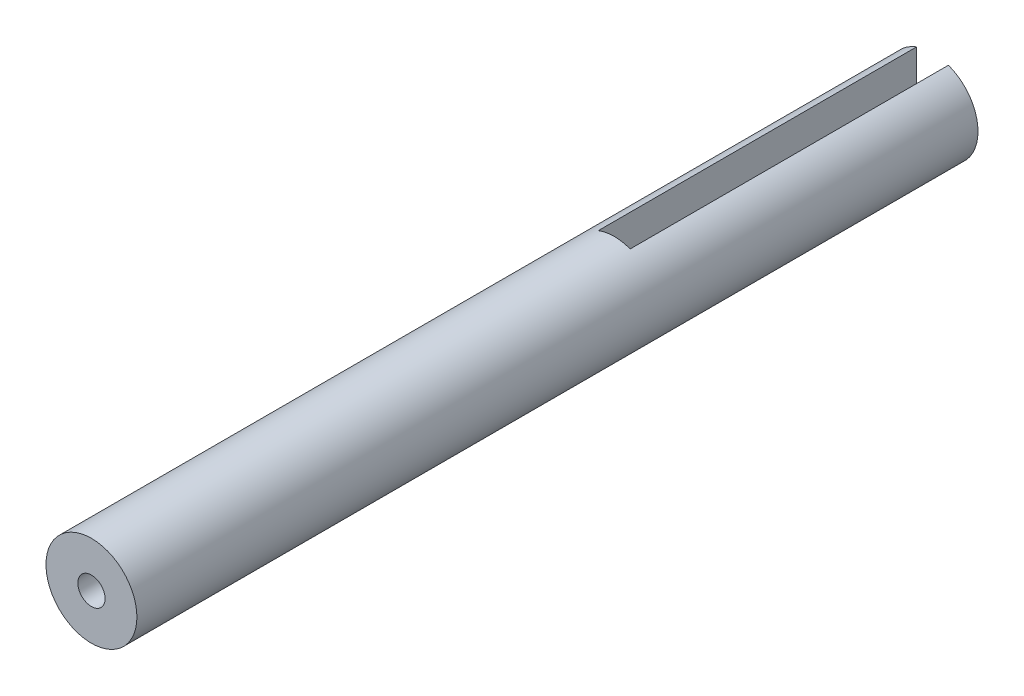
ISO-10303-21;
HEADER;
FILE_DESCRIPTION(('STEP AP214'),'2;1');
FILE_NAME('part.step','',(''),(''),'','','');
FILE_SCHEMA(('AUTOMOTIVE_DESIGN { 1 0 10303 214 1 1 1 1 }'));
ENDSEC;
DATA;
#1=APPLICATION_CONTEXT('core data for automotive mechanical design processes');
#2=APPLICATION_PROTOCOL_DEFINITION('international standard','automotive_design',2000,#1);
#3=PRODUCT_CONTEXT('',#1,'mechanical');
#4=PRODUCT('Part','Part','',(#3));
#5=PRODUCT_RELATED_PRODUCT_CATEGORY('part','',(#4));
#6=PRODUCT_DEFINITION_FORMATION('','',#4);
#7=PRODUCT_DEFINITION_CONTEXT('part definition',#1,'design');
#8=PRODUCT_DEFINITION('design','',#6,#7);
#9=PRODUCT_DEFINITION_SHAPE('','',#8);
#10=(LENGTH_UNIT() NAMED_UNIT(*) SI_UNIT(.MILLI.,.METRE.));
#11=(NAMED_UNIT(*) PLANE_ANGLE_UNIT() SI_UNIT($,.RADIAN.));
#12=(NAMED_UNIT(*) SI_UNIT($,.STERADIAN.) SOLID_ANGLE_UNIT());
#13=UNCERTAINTY_MEASURE_WITH_UNIT(LENGTH_MEASURE(1.E-05),#10,'distance_accuracy_value','');
#14=(GEOMETRIC_REPRESENTATION_CONTEXT(3) GLOBAL_UNCERTAINTY_ASSIGNED_CONTEXT((#13)) GLOBAL_UNIT_ASSIGNED_CONTEXT((#10,
#11,#12)) REPRESENTATION_CONTEXT('',''));
#15=CARTESIAN_POINT('',(0.,0.,0.));
#16=DIRECTION('',(0.,0.,1.));
#17=DIRECTION('',(1.,0.,0.));
#18=AXIS2_PLACEMENT_3D('',#15,#16,#17);
#19=CARTESIAN_POINT('',(0.,0.,0.));
#20=DIRECTION('',(0.,0.,1.));
#21=DIRECTION('',(1.,0.,0.));
#22=AXIS2_PLACEMENT_3D('',#19,#20,#21);
#23=PLANE('',#22);
#24=DIRECTION('',(0.,-1.,0.));
#25=VECTOR('',#24,1.);
#26=CARTESIAN_POINT('',(-3.5,0.,0.));
#27=LINE('',#26,#25);
#28=CARTESIAN_POINT('',(-3.5,9.3674969975976,0.));
#29=VERTEX_POINT('',#28);
#30=CARTESIAN_POINT('',(-3.5,-9.3674969975976,0.));
#31=VERTEX_POINT('',#30);
#32=EDGE_CURVE('E89',#29,#31,#27,.T.);
#33=ORIENTED_EDGE('',*,*,#32,.T.);
#34=CARTESIAN_POINT('',(0.,0.,0.));
#35=DIRECTION('',(0.,0.,1.));
#36=DIRECTION('',(1.,0.,0.));
#37=AXIS2_PLACEMENT_3D('',#34,#35,#36);
#38=CIRCLE('',#37,10.);
#39=EDGE_CURVE('E47',#29,#31,#38,.T.);
#40=ORIENTED_EDGE('',*,*,#39,.F.);
#41=EDGE_LOOP('',(#33,#40));
#42=FACE_BOUND('',#41,.T.);
#43=ADVANCED_FACE('F37',(#42),#23,.F.);
#44=CARTESIAN_POINT('',(0.,0.,185.));
#45=DIRECTION('',(0.,0.,-1.));
#46=DIRECTION('',(-1.,0.,0.));
#47=AXIS2_PLACEMENT_3D('',#44,#45,#46);
#48=CYLINDRICAL_SURFACE('',#47,10.);
#49=CARTESIAN_POINT('',(3.5,-9.3674969975976,0.));
#50=VERTEX_POINT('',#49);
#51=CARTESIAN_POINT('',(3.5,9.3674969975976,0.));
#52=VERTEX_POINT('',#51);
#53=EDGE_CURVE('E41',#50,#52,#38,.T.);
#54=ORIENTED_EDGE('',*,*,#53,.T.);
#55=DIRECTION('',(0.,0.,-1.));
#56=VECTOR('',#55,1.);
#57=CARTESIAN_POINT('',(3.5,9.3674969975976,70.));
#58=LINE('',#57,#56);
#59=CARTESIAN_POINT('',(3.5,9.3674969975976,70.));
#60=VERTEX_POINT('',#59);
#61=EDGE_CURVE('E94',#60,#52,#58,.T.);
#62=ORIENTED_EDGE('',*,*,#61,.F.);
#63=CARTESIAN_POINT('',(0.,0.,70.));
#64=DIRECTION('',(0.,0.,1.));
#65=DIRECTION('',(1.,0.,0.));
#66=AXIS2_PLACEMENT_3D('',#63,#64,#65);
#67=CIRCLE('',#66,10.);
#68=CARTESIAN_POINT('',(-3.5,9.3674969975976,70.));
#69=VERTEX_POINT('',#68);
#70=EDGE_CURVE('E82',#60,#69,#67,.T.);
#71=ORIENTED_EDGE('',*,*,#70,.T.);
#72=DIRECTION('',(0.,0.,-1.));
#73=VECTOR('',#72,1.);
#74=CARTESIAN_POINT('',(-3.5,9.3674969975976,70.));
#75=LINE('',#74,#73);
#76=EDGE_CURVE('E85',#69,#29,#75,.T.);
#77=ORIENTED_EDGE('',*,*,#76,.T.);
#78=ORIENTED_EDGE('',*,*,#39,.T.);
#79=DIRECTION('',(0.,0.,-1.));
#80=VECTOR('',#79,1.);
#81=CARTESIAN_POINT('',(-3.5,-9.3674969975976,70.));
#82=LINE('',#81,#80);
#83=CARTESIAN_POINT('',(-3.5,-9.3674969975976,70.));
#84=VERTEX_POINT('',#83);
#85=EDGE_CURVE('E54',#84,#31,#82,.T.);
#86=ORIENTED_EDGE('',*,*,#85,.F.);
#87=CARTESIAN_POINT('',(3.5,-9.3674969975976,70.));
#88=VERTEX_POINT('',#87);
#89=EDGE_CURVE('E98',#84,#88,#67,.T.);
#90=ORIENTED_EDGE('',*,*,#89,.T.);
#91=DIRECTION('',(0.,0.,-1.));
#92=VECTOR('',#91,1.);
#93=CARTESIAN_POINT('',(3.5,-9.3674969975976,70.));
#94=LINE('',#93,#92);
#95=EDGE_CURVE('E63',#88,#50,#94,.T.);
#96=ORIENTED_EDGE('',*,*,#95,.T.);
#97=EDGE_LOOP('',(#54,#62,#71,#77,#78,#86,#90,#96));
#98=FACE_BOUND('',#97,.T.);
#99=CARTESIAN_POINT('',(0.,0.,185.));
#100=DIRECTION('',(0.,0.,1.));
#101=DIRECTION('',(1.,0.,0.));
#102=AXIS2_PLACEMENT_3D('',#99,#100,#101);
#103=CIRCLE('',#102,10.);
#104=CARTESIAN_POINT('',(10.,0.,185.));
#105=VERTEX_POINT('',#104);
#106=EDGE_CURVE('E11',#105,#105,#103,.T.);
#107=ORIENTED_EDGE('',*,*,#106,.F.);
#108=EDGE_LOOP('',(#107));
#109=FACE_BOUND('',#108,.T.);
#110=ADVANCED_FACE('F39',(#98,#109),#48,.T.);
#111=CARTESIAN_POINT('',(0.,0.,185.));
#112=DIRECTION('',(0.,0.,1.));
#113=DIRECTION('',(1.,0.,0.));
#114=AXIS2_PLACEMENT_3D('',#111,#112,#113);
#115=PLANE('',#114);
#116=CARTESIAN_POINT('',(0.,0.,185.));
#117=DIRECTION('',(0.,0.,1.));
#118=DIRECTION('',(1.,0.,0.));
#119=AXIS2_PLACEMENT_3D('',#116,#117,#118);
#120=CIRCLE('',#119,3.);
#121=CARTESIAN_POINT('',(3.,0.,185.));
#122=VERTEX_POINT('',#121);
#123=EDGE_CURVE('E127',#122,#122,#120,.T.);
#124=ORIENTED_EDGE('',*,*,#123,.F.);
#125=EDGE_LOOP('',(#124));
#126=FACE_BOUND('',#125,.T.);
#127=ORIENTED_EDGE('',*,*,#106,.T.);
#128=EDGE_LOOP('',(#127));
#129=FACE_BOUND('',#128,.T.);
#130=ADVANCED_FACE('F138',(#126,#129),#115,.T.);
#131=ORIENTED_EDGE('',*,*,#53,.F.);
#132=DIRECTION('',(0.,-1.,0.));
#133=VECTOR('',#132,1.);
#134=CARTESIAN_POINT('',(3.5,0.,0.));
#135=LINE('',#134,#133);
#136=EDGE_CURVE('E76',#52,#50,#135,.T.);
#137=ORIENTED_EDGE('',*,*,#136,.F.);
#138=EDGE_LOOP('',(#131,#137));
#139=FACE_BOUND('',#138,.T.);
#140=ADVANCED_FACE('F141',(#139),#23,.F.);
#141=CARTESIAN_POINT('',(3.5,0.,70.));
#142=DIRECTION('',(1.,0.,0.));
#143=DIRECTION('',(0.,1.,0.));
#144=AXIS2_PLACEMENT_3D('',#141,#142,#143);
#145=PLANE('',#144);
#146=ORIENTED_EDGE('',*,*,#136,.T.);
#147=ORIENTED_EDGE('',*,*,#95,.F.);
#148=DIRECTION('',(0.,-1.,0.));
#149=VECTOR('',#148,1.);
#150=CARTESIAN_POINT('',(3.5,0.,70.));
#151=LINE('',#150,#149);
#152=EDGE_CURVE('E105',#60,#88,#151,.T.);
#153=ORIENTED_EDGE('',*,*,#152,.F.);
#154=ORIENTED_EDGE('',*,*,#61,.T.);
#155=EDGE_LOOP('',(#146,#147,#153,#154));
#156=FACE_BOUND('',#155,.T.);
#157=ADVANCED_FACE('F151',(#156),#145,.F.);
#158=CARTESIAN_POINT('',(-3.5,0.,70.));
#159=DIRECTION('',(1.,0.,0.));
#160=DIRECTION('',(0.,1.,0.));
#161=AXIS2_PLACEMENT_3D('',#158,#159,#160);
#162=PLANE('',#161);
#163=ORIENTED_EDGE('',*,*,#32,.F.);
#164=ORIENTED_EDGE('',*,*,#76,.F.);
#165=DIRECTION('',(0.,-1.,0.));
#166=VECTOR('',#165,1.);
#167=CARTESIAN_POINT('',(-3.5,0.,70.));
#168=LINE('',#167,#166);
#169=EDGE_CURVE('E87',#69,#84,#168,.T.);
#170=ORIENTED_EDGE('',*,*,#169,.T.);
#171=ORIENTED_EDGE('',*,*,#85,.T.);
#172=EDGE_LOOP('',(#163,#164,#170,#171));
#173=FACE_BOUND('',#172,.T.);
#174=ADVANCED_FACE('F86',(#173),#162,.T.);
#175=CARTESIAN_POINT('',(0.,0.,70.));
#176=DIRECTION('',(0.,0.,1.));
#177=DIRECTION('',(1.,0.,0.));
#178=AXIS2_PLACEMENT_3D('',#175,#176,#177);
#179=PLANE('',#178);
#180=ORIENTED_EDGE('',*,*,#152,.T.);
#181=ORIENTED_EDGE('',*,*,#89,.F.);
#182=ORIENTED_EDGE('',*,*,#169,.F.);
#183=ORIENTED_EDGE('',*,*,#70,.F.);
#184=EDGE_LOOP('',(#180,#181,#182,#183));
#185=FACE_BOUND('',#184,.T.);
#186=ADVANCED_FACE('F96',(#185),#179,.F.);
#187=CARTESIAN_POINT('',(0.,0.,165.));
#188=DIRECTION('',(0.,0.,1.));
#189=DIRECTION('',(1.,0.,0.));
#190=AXIS2_PLACEMENT_3D('',#187,#188,#189);
#191=CYLINDRICAL_SURFACE('',#190,3.);
#192=CARTESIAN_POINT('',(0.,0.,165.));
#193=DIRECTION('',(0.,0.,1.));
#194=DIRECTION('',(1.,0.,0.));
#195=AXIS2_PLACEMENT_3D('',#192,#193,#194);
#196=CIRCLE('',#195,3.);
#197=CARTESIAN_POINT('',(3.,0.,165.));
#198=VERTEX_POINT('',#197);
#199=EDGE_CURVE('E124',#198,#198,#196,.T.);
#200=ORIENTED_EDGE('',*,*,#199,.F.);
#201=EDGE_LOOP('',(#200));
#202=FACE_BOUND('',#201,.T.);
#203=ORIENTED_EDGE('',*,*,#123,.T.);
#204=EDGE_LOOP('',(#203));
#205=FACE_BOUND('',#204,.T.);
#206=ADVANCED_FACE('F136',(#202,#205),#191,.F.);
#207=CARTESIAN_POINT('',(0.,0.,165.));
#208=DIRECTION('',(0.,0.,1.));
#209=DIRECTION('',(1.,0.,0.));
#210=AXIS2_PLACEMENT_3D('',#207,#208,#209);
#211=PLANE('',#210);
#212=ORIENTED_EDGE('',*,*,#199,.T.);
#213=EDGE_LOOP('',(#212));
#214=FACE_BOUND('',#213,.T.);
#215=ADVANCED_FACE('F166',(#214),#211,.T.);
#216=CLOSED_SHELL('',(#43,#110,#130,#140,#157,#174,#186,#206,#215));
#217=MANIFOLD_SOLID_BREP('B2',#216);
#218=ADVANCED_BREP_SHAPE_REPRESENTATION('',(#18,#217),#14);
#219=SHAPE_DEFINITION_REPRESENTATION(#9,#218);
ENDSEC;
END-ISO-10303-21;
